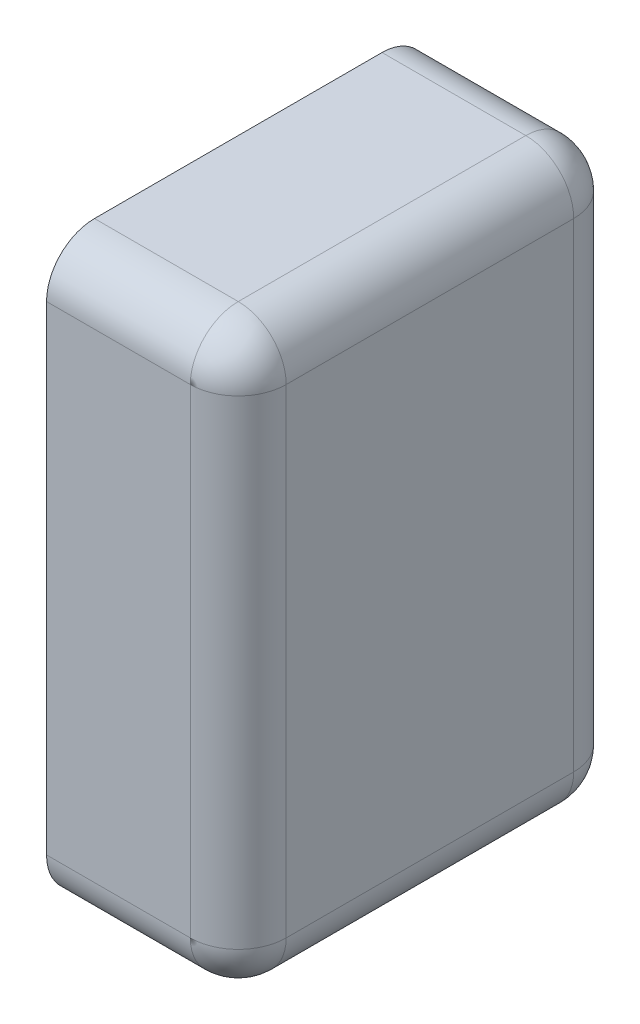
ISO-10303-21;
HEADER;
FILE_DESCRIPTION(('STEP AP214'),'2;1');
FILE_NAME('part.step','',(''),(''),'','','');
FILE_SCHEMA(('AUTOMOTIVE_DESIGN { 1 0 10303 214 1 1 1 1 }'));
ENDSEC;
DATA;
#1=APPLICATION_CONTEXT('core data for automotive mechanical design processes');
#2=APPLICATION_PROTOCOL_DEFINITION('international standard','automotive_design',2000,#1);
#3=PRODUCT_CONTEXT('',#1,'mechanical');
#4=PRODUCT('Part','Part','',(#3));
#5=PRODUCT_RELATED_PRODUCT_CATEGORY('part','',(#4));
#6=PRODUCT_DEFINITION_FORMATION('','',#4);
#7=PRODUCT_DEFINITION_CONTEXT('part definition',#1,'design');
#8=PRODUCT_DEFINITION('design','',#6,#7);
#9=PRODUCT_DEFINITION_SHAPE('','',#8);
#10=(LENGTH_UNIT() NAMED_UNIT(*) SI_UNIT(.MILLI.,.METRE.));
#11=(NAMED_UNIT(*) PLANE_ANGLE_UNIT() SI_UNIT($,.RADIAN.));
#12=(NAMED_UNIT(*) SI_UNIT($,.STERADIAN.) SOLID_ANGLE_UNIT());
#13=UNCERTAINTY_MEASURE_WITH_UNIT(LENGTH_MEASURE(1.E-05),#10,'distance_accuracy_value','');
#14=(GEOMETRIC_REPRESENTATION_CONTEXT(3) GLOBAL_UNCERTAINTY_ASSIGNED_CONTEXT((#13)) GLOBAL_UNIT_ASSIGNED_CONTEXT((#10,
#11,#12)) REPRESENTATION_CONTEXT('',''));
#15=CARTESIAN_POINT('',(0.,0.,0.));
#16=DIRECTION('',(0.,0.,1.));
#17=DIRECTION('',(1.,0.,0.));
#18=AXIS2_PLACEMENT_3D('',#15,#16,#17);
#19=CARTESIAN_POINT('',(0.275,-0.125,0.1));
#20=DIRECTION('',(0.,0.,-1.));
#21=DIRECTION('',(1.,0.,0.));
#22=AXIS2_PLACEMENT_3D('',#19,#20,#21);
#23=CYLINDRICAL_SURFACE('',#22,0.025);
#24=CARTESIAN_POINT('',(0.275,-0.125,0.025));
#25=DIRECTION('',(0.,0.,1.));
#26=DIRECTION('',(0.,1.,0.));
#27=AXIS2_PLACEMENT_3D('',#24,#25,#26);
#28=CIRCLE('',#27,0.025);
#29=CARTESIAN_POINT('',(0.275,-0.15,0.025));
#30=VERTEX_POINT('',#29);
#31=CARTESIAN_POINT('',(0.3,-0.125,0.025));
#32=VERTEX_POINT('',#31);
#33=EDGE_CURVE('E11',#30,#32,#28,.T.);
#34=ORIENTED_EDGE('',*,*,#33,.T.);
#35=DIRECTION('',(0.,0.,-1.));
#36=VECTOR('',#35,1.);
#37=CARTESIAN_POINT('',(0.3,-0.125,0.));
#38=LINE('',#37,#36);
#39=CARTESIAN_POINT('',(0.3,-0.125,0.175));
#40=VERTEX_POINT('',#39);
#41=EDGE_CURVE('E178',#40,#32,#38,.T.);
#42=ORIENTED_EDGE('',*,*,#41,.F.);
#43=CARTESIAN_POINT('',(0.275,-0.125,0.175));
#44=DIRECTION('',(0.,0.,1.));
#45=DIRECTION('',(1.,0.,0.));
#46=AXIS2_PLACEMENT_3D('',#43,#44,#45);
#47=CIRCLE('',#46,0.025);
#48=CARTESIAN_POINT('',(0.275,-0.15,0.175));
#49=VERTEX_POINT('',#48);
#50=EDGE_CURVE('E200',#49,#40,#47,.T.);
#51=ORIENTED_EDGE('',*,*,#50,.F.);
#52=DIRECTION('',(0.,0.,1.));
#53=VECTOR('',#52,1.);
#54=CARTESIAN_POINT('',(0.275,-0.15,0.2));
#55=LINE('',#54,#53);
#56=EDGE_CURVE('E87',#30,#49,#55,.T.);
#57=ORIENTED_EDGE('',*,*,#56,.F.);
#58=EDGE_LOOP('',(#34,#42,#51,#57));
#59=FACE_BOUND('',#58,.T.);
#60=ADVANCED_FACE('F17',(#59),#23,.T.);
#61=CARTESIAN_POINT('',(0.275,0.125,0.025));
#62=DIRECTION('',(0.,0.,1.));
#63=DIRECTION('',(1.,0.,0.));
#64=AXIS2_PLACEMENT_3D('',#61,#62,#63);
#65=SPHERICAL_SURFACE('',#64,0.025);
#66=CARTESIAN_POINT('',(0.275,0.125,0.025));
#67=DIRECTION('',(0.,1.,0.));
#68=DIRECTION('',(0.,0.,1.));
#69=AXIS2_PLACEMENT_3D('',#66,#67,#68);
#70=CIRCLE('',#69,0.025);
#71=CARTESIAN_POINT('',(0.3,0.125,0.025));
#72=VERTEX_POINT('',#71);
#73=CARTESIAN_POINT('',(0.275,0.125,0.));
#74=VERTEX_POINT('',#73);
#75=EDGE_CURVE('E212',#72,#74,#70,.T.);
#76=ORIENTED_EDGE('',*,*,#75,.T.);
#77=CARTESIAN_POINT('',(0.275,0.125,0.025));
#78=DIRECTION('',(1.,0.,0.));
#79=DIRECTION('',(0.,0.,-1.));
#80=AXIS2_PLACEMENT_3D('',#77,#78,#79);
#81=CIRCLE('',#80,0.025);
#82=CARTESIAN_POINT('',(0.275,0.15,0.025));
#83=VERTEX_POINT('',#82);
#84=EDGE_CURVE('E28',#74,#83,#81,.T.);
#85=ORIENTED_EDGE('',*,*,#84,.T.);
#86=CARTESIAN_POINT('',(0.275,0.125,0.025));
#87=DIRECTION('',(0.,0.,1.));
#88=DIRECTION('',(-1.,0.,0.));
#89=AXIS2_PLACEMENT_3D('',#86,#87,#88);
#90=CIRCLE('',#89,0.025);
#91=EDGE_CURVE('E232',#72,#83,#90,.T.);
#92=ORIENTED_EDGE('',*,*,#91,.F.);
#93=EDGE_LOOP('',(#76,#85,#92));
#94=FACE_BOUND('',#93,.T.);
#95=ADVANCED_FACE('F274',(#94),#65,.T.);
#96=CARTESIAN_POINT('',(0.275,-0.125,0.025));
#97=DIRECTION('',(0.,0.,1.));
#98=DIRECTION('',(1.,0.,0.));
#99=AXIS2_PLACEMENT_3D('',#96,#97,#98);
#100=SPHERICAL_SURFACE('',#99,0.025);
#101=CARTESIAN_POINT('',(0.275,-0.125,0.025));
#102=DIRECTION('',(1.,0.,0.));
#103=DIRECTION('',(0.,0.,-1.));
#104=AXIS2_PLACEMENT_3D('',#101,#102,#103);
#105=CIRCLE('',#104,0.025);
#106=CARTESIAN_POINT('',(0.275,-0.125,0.));
#107=VERTEX_POINT('',#106);
#108=EDGE_CURVE('E138',#30,#107,#105,.T.);
#109=ORIENTED_EDGE('',*,*,#108,.T.);
#110=CARTESIAN_POINT('',(0.275,-0.125,0.025));
#111=DIRECTION('',(0.,-1.,0.));
#112=DIRECTION('',(0.,0.,-1.));
#113=AXIS2_PLACEMENT_3D('',#110,#111,#112);
#114=CIRCLE('',#113,0.025);
#115=EDGE_CURVE('E213',#107,#32,#114,.T.);
#116=ORIENTED_EDGE('',*,*,#115,.T.);
#117=ORIENTED_EDGE('',*,*,#33,.F.);
#118=EDGE_LOOP('',(#109,#116,#117));
#119=FACE_BOUND('',#118,.T.);
#120=ADVANCED_FACE('F280',(#119),#100,.T.);
#121=CARTESIAN_POINT('',(0.15,0.125,0.025));
#122=DIRECTION('',(1.,0.,0.));
#123=DIRECTION('',(0.,0.,1.));
#124=AXIS2_PLACEMENT_3D('',#121,#122,#123);
#125=CYLINDRICAL_SURFACE('',#124,0.025);
#126=CARTESIAN_POINT('',(0.2,0.125,0.025));
#127=DIRECTION('',(-1.,0.,0.));
#128=DIRECTION('',(0.,0.,-1.));
#129=AXIS2_PLACEMENT_3D('',#126,#127,#128);
#130=CIRCLE('',#129,0.025);
#131=CARTESIAN_POINT('',(0.2,0.15,0.025));
#132=VERTEX_POINT('',#131);
#133=CARTESIAN_POINT('',(0.2,0.125,0.));
#134=VERTEX_POINT('',#133);
#135=EDGE_CURVE('E131',#132,#134,#130,.T.);
#136=ORIENTED_EDGE('',*,*,#135,.F.);
#137=DIRECTION('',(-1.,0.,0.));
#138=VECTOR('',#137,1.);
#139=CARTESIAN_POINT('',(0.15,0.15,0.025));
#140=LINE('',#139,#138);
#141=EDGE_CURVE('E182',#83,#132,#140,.T.);
#142=ORIENTED_EDGE('',*,*,#141,.F.);
#143=ORIENTED_EDGE('',*,*,#84,.F.);
#144=DIRECTION('',(1.,0.,0.));
#145=VECTOR('',#144,1.);
#146=CARTESIAN_POINT('',(0.25,0.125,0.));
#147=LINE('',#146,#145);
#148=EDGE_CURVE('E127',#134,#74,#147,.T.);
#149=ORIENTED_EDGE('',*,*,#148,.F.);
#150=EDGE_LOOP('',(#136,#142,#143,#149));
#151=FACE_BOUND('',#150,.T.);
#152=ADVANCED_FACE('F129',(#151),#125,.T.);
#153=CARTESIAN_POINT('',(0.25,-0.125,0.025));
#154=DIRECTION('',(-1.,0.,0.));
#155=DIRECTION('',(0.,0.,-1.));
#156=AXIS2_PLACEMENT_3D('',#153,#154,#155);
#157=CYLINDRICAL_SURFACE('',#156,0.025);
#158=CARTESIAN_POINT('',(0.2,-0.125,0.025));
#159=DIRECTION('',(-1.,0.,0.));
#160=DIRECTION('',(0.,0.,-1.));
#161=AXIS2_PLACEMENT_3D('',#158,#159,#160);
#162=CIRCLE('',#161,0.025);
#163=CARTESIAN_POINT('',(0.2,-0.125,0.));
#164=VERTEX_POINT('',#163);
#165=CARTESIAN_POINT('',(0.2,-0.15,0.025));
#166=VERTEX_POINT('',#165);
#167=EDGE_CURVE('E155',#164,#166,#162,.T.);
#168=ORIENTED_EDGE('',*,*,#167,.F.);
#169=DIRECTION('',(-1.,0.,0.));
#170=VECTOR('',#169,1.);
#171=CARTESIAN_POINT('',(0.2,-0.125,0.));
#172=LINE('',#171,#170);
#173=EDGE_CURVE('E139',#107,#164,#172,.T.);
#174=ORIENTED_EDGE('',*,*,#173,.F.);
#175=ORIENTED_EDGE('',*,*,#108,.F.);
#176=DIRECTION('',(1.,0.,0.));
#177=VECTOR('',#176,1.);
#178=CARTESIAN_POINT('',(0.3,-0.15,0.025));
#179=LINE('',#178,#177);
#180=EDGE_CURVE('E174',#166,#30,#179,.T.);
#181=ORIENTED_EDGE('',*,*,#180,.F.);
#182=EDGE_LOOP('',(#168,#174,#175,#181));
#183=FACE_BOUND('',#182,.T.);
#184=ADVANCED_FACE('F272',(#183),#157,.T.);
#185=CARTESIAN_POINT('',(0.25,-0.15,0.));
#186=DIRECTION('',(0.,0.,1.));
#187=DIRECTION('',(1.,0.,0.));
#188=AXIS2_PLACEMENT_3D('',#185,#186,#187);
#189=PLANE('',#188);
#190=DIRECTION('',(0.,-1.,0.));
#191=VECTOR('',#190,1.);
#192=CARTESIAN_POINT('',(0.275,-0.15,0.));
#193=LINE('',#192,#191);
#194=EDGE_CURVE('E209',#74,#107,#193,.T.);
#195=ORIENTED_EDGE('',*,*,#194,.T.);
#196=ORIENTED_EDGE('',*,*,#173,.T.);
#197=DIRECTION('',(0.,1.,0.));
#198=VECTOR('',#197,1.);
#199=CARTESIAN_POINT('',(0.2,-0.15,0.));
#200=LINE('',#199,#198);
#201=EDGE_CURVE('E145',#164,#134,#200,.T.);
#202=ORIENTED_EDGE('',*,*,#201,.T.);
#203=ORIENTED_EDGE('',*,*,#148,.T.);
#204=EDGE_LOOP('',(#195,#196,#202,#203));
#205=FACE_BOUND('',#204,.T.);
#206=ADVANCED_FACE('F151',(#205),#189,.F.);
#207=CARTESIAN_POINT('',(0.3,-0.15,0.1));
#208=DIRECTION('',(-1.,0.,0.));
#209=DIRECTION('',(0.,0.,1.));
#210=AXIS2_PLACEMENT_3D('',#207,#208,#209);
#211=PLANE('',#210);
#212=DIRECTION('',(0.,-1.,0.));
#213=VECTOR('',#212,1.);
#214=CARTESIAN_POINT('',(0.3,-0.15,0.175));
#215=LINE('',#214,#213);
#216=CARTESIAN_POINT('',(0.3,0.125,0.175));
#217=VERTEX_POINT('',#216);
#218=EDGE_CURVE('E188',#217,#40,#215,.T.);
#219=ORIENTED_EDGE('',*,*,#218,.T.);
#220=ORIENTED_EDGE('',*,*,#41,.T.);
#221=DIRECTION('',(0.,1.,0.));
#222=VECTOR('',#221,1.);
#223=CARTESIAN_POINT('',(0.3,-0.15,0.025));
#224=LINE('',#223,#222);
#225=EDGE_CURVE('E177',#32,#72,#224,.T.);
#226=ORIENTED_EDGE('',*,*,#225,.T.);
#227=DIRECTION('',(0.,0.,1.));
#228=VECTOR('',#227,1.);
#229=CARTESIAN_POINT('',(0.3,0.125,0.1));
#230=LINE('',#229,#228);
#231=EDGE_CURVE('E198',#72,#217,#230,.T.);
#232=ORIENTED_EDGE('',*,*,#231,.T.);
#233=EDGE_LOOP('',(#219,#220,#226,#232));
#234=FACE_BOUND('',#233,.T.);
#235=ADVANCED_FACE('F255',(#234),#211,.F.);
#236=CARTESIAN_POINT('',(0.15,0.15,0.1));
#237=DIRECTION('',(0.,-1.,0.));
#238=DIRECTION('',(0.,0.,-1.));
#239=AXIS2_PLACEMENT_3D('',#236,#237,#238);
#240=PLANE('',#239);
#241=DIRECTION('',(0.,0.,-1.));
#242=VECTOR('',#241,1.);
#243=CARTESIAN_POINT('',(0.275,0.15,0.1));
#244=LINE('',#243,#242);
#245=CARTESIAN_POINT('',(0.275,0.15,0.175));
#246=VERTEX_POINT('',#245);
#247=EDGE_CURVE('E208',#246,#83,#244,.T.);
#248=ORIENTED_EDGE('',*,*,#247,.T.);
#249=ORIENTED_EDGE('',*,*,#141,.T.);
#250=DIRECTION('',(0.,0.,1.));
#251=VECTOR('',#250,1.);
#252=CARTESIAN_POINT('',(0.2,0.15,0.189600024));
#253=LINE('',#252,#251);
#254=CARTESIAN_POINT('',(0.2,0.15,0.175));
#255=VERTEX_POINT('',#254);
#256=EDGE_CURVE('E147',#132,#255,#253,.T.);
#257=ORIENTED_EDGE('',*,*,#256,.T.);
#258=DIRECTION('',(1.,0.,0.));
#259=VECTOR('',#258,1.);
#260=CARTESIAN_POINT('',(0.15,0.15,0.175));
#261=LINE('',#260,#259);
#262=EDGE_CURVE('E236',#255,#246,#261,.T.);
#263=ORIENTED_EDGE('',*,*,#262,.T.);
#264=EDGE_LOOP('',(#248,#249,#257,#263));
#265=FACE_BOUND('',#264,.T.);
#266=ADVANCED_FACE('F294',(#265),#240,.F.);
#267=CARTESIAN_POINT('',(0.15,-0.15,0.1));
#268=DIRECTION('',(0.,-1.,0.));
#269=DIRECTION('',(0.,0.,-1.));
#270=AXIS2_PLACEMENT_3D('',#267,#268,#269);
#271=PLANE('',#270);
#272=DIRECTION('',(0.,0.,1.));
#273=VECTOR('',#272,1.);
#274=CARTESIAN_POINT('',(0.2,-0.15,0.189600024));
#275=LINE('',#274,#273);
#276=CARTESIAN_POINT('',(0.2,-0.15,0.175));
#277=VERTEX_POINT('',#276);
#278=EDGE_CURVE('E162',#166,#277,#275,.T.);
#279=ORIENTED_EDGE('',*,*,#278,.F.);
#280=ORIENTED_EDGE('',*,*,#180,.T.);
#281=ORIENTED_EDGE('',*,*,#56,.T.);
#282=DIRECTION('',(-1.,0.,0.));
#283=VECTOR('',#282,1.);
#284=CARTESIAN_POINT('',(0.2,-0.15,0.175));
#285=LINE('',#284,#283);
#286=EDGE_CURVE('E197',#49,#277,#285,.T.);
#287=ORIENTED_EDGE('',*,*,#286,.T.);
#288=EDGE_LOOP('',(#279,#280,#281,#287));
#289=FACE_BOUND('',#288,.T.);
#290=ADVANCED_FACE('F270',(#289),#271,.T.);
#291=CARTESIAN_POINT('',(0.275,-0.15,0.025));
#292=DIRECTION('',(0.,-1.,0.));
#293=DIRECTION('',(0.,0.,1.));
#294=AXIS2_PLACEMENT_3D('',#291,#292,#293);
#295=CYLINDRICAL_SURFACE('',#294,0.025);
#296=ORIENTED_EDGE('',*,*,#115,.F.);
#297=ORIENTED_EDGE('',*,*,#194,.F.);
#298=ORIENTED_EDGE('',*,*,#75,.F.);
#299=ORIENTED_EDGE('',*,*,#225,.F.);
#300=EDGE_LOOP('',(#296,#297,#298,#299));
#301=FACE_BOUND('',#300,.T.);
#302=ADVANCED_FACE('F19',(#301),#295,.T.);
#303=CARTESIAN_POINT('',(0.275,-0.125,0.175));
#304=DIRECTION('',(0.,0.,1.));
#305=DIRECTION('',(1.,0.,0.));
#306=AXIS2_PLACEMENT_3D('',#303,#304,#305);
#307=SPHERICAL_SURFACE('',#306,0.025);
#308=CARTESIAN_POINT('',(0.275,-0.125,0.175));
#309=DIRECTION('',(1.,0.,0.));
#310=DIRECTION('',(0.,0.,-1.));
#311=AXIS2_PLACEMENT_3D('',#308,#309,#310);
#312=CIRCLE('',#311,0.025);
#313=CARTESIAN_POINT('',(0.275,-0.125,0.2));
#314=VERTEX_POINT('',#313);
#315=EDGE_CURVE('E166',#314,#49,#312,.T.);
#316=ORIENTED_EDGE('',*,*,#315,.T.);
#317=ORIENTED_EDGE('',*,*,#50,.T.);
#318=CARTESIAN_POINT('',(0.275,-0.125,0.175));
#319=DIRECTION('',(0.,1.,0.));
#320=DIRECTION('',(0.,0.,-1.));
#321=AXIS2_PLACEMENT_3D('',#318,#319,#320);
#322=CIRCLE('',#321,0.025);
#323=EDGE_CURVE('E72',#314,#40,#322,.T.);
#324=ORIENTED_EDGE('',*,*,#323,.F.);
#325=EDGE_LOOP('',(#316,#317,#324));
#326=FACE_BOUND('',#325,.T.);
#327=ADVANCED_FACE('F249',(#326),#307,.T.);
#328=CARTESIAN_POINT('',(0.275,0.125,0.175));
#329=DIRECTION('',(0.,0.,1.));
#330=DIRECTION('',(1.,0.,0.));
#331=AXIS2_PLACEMENT_3D('',#328,#329,#330);
#332=SPHERICAL_SURFACE('',#331,0.025);
#333=CARTESIAN_POINT('',(0.275,0.125,0.175));
#334=DIRECTION('',(0.,0.,1.));
#335=DIRECTION('',(1.,0.,0.));
#336=AXIS2_PLACEMENT_3D('',#333,#334,#335);
#337=CIRCLE('',#336,0.025);
#338=EDGE_CURVE('E204',#217,#246,#337,.T.);
#339=ORIENTED_EDGE('',*,*,#338,.T.);
#340=CARTESIAN_POINT('',(0.275,0.125,0.175));
#341=DIRECTION('',(1.,0.,0.));
#342=DIRECTION('',(0.,0.,-1.));
#343=AXIS2_PLACEMENT_3D('',#340,#341,#342);
#344=CIRCLE('',#343,0.025);
#345=CARTESIAN_POINT('',(0.275,0.125,0.2));
#346=VERTEX_POINT('',#345);
#347=EDGE_CURVE('E170',#246,#346,#344,.T.);
#348=ORIENTED_EDGE('',*,*,#347,.T.);
#349=CARTESIAN_POINT('',(0.275,0.125,0.175));
#350=DIRECTION('',(0.,-1.,0.));
#351=DIRECTION('',(0.,0.,1.));
#352=AXIS2_PLACEMENT_3D('',#349,#350,#351);
#353=CIRCLE('',#352,0.025);
#354=EDGE_CURVE('E192',#217,#346,#353,.T.);
#355=ORIENTED_EDGE('',*,*,#354,.F.);
#356=EDGE_LOOP('',(#339,#348,#355));
#357=FACE_BOUND('',#356,.T.);
#358=ADVANCED_FACE('F312',(#357),#332,.T.);
#359=CARTESIAN_POINT('',(0.275,-0.15,0.175));
#360=DIRECTION('',(0.,-1.,0.));
#361=DIRECTION('',(0.,0.,1.));
#362=AXIS2_PLACEMENT_3D('',#359,#360,#361);
#363=CYLINDRICAL_SURFACE('',#362,0.025);
#364=ORIENTED_EDGE('',*,*,#323,.T.);
#365=ORIENTED_EDGE('',*,*,#218,.F.);
#366=ORIENTED_EDGE('',*,*,#354,.T.);
#367=DIRECTION('',(0.,1.,0.));
#368=VECTOR('',#367,1.);
#369=CARTESIAN_POINT('',(0.275,-0.15,0.2));
#370=LINE('',#369,#368);
#371=EDGE_CURVE('E149',#314,#346,#370,.T.);
#372=ORIENTED_EDGE('',*,*,#371,.F.);
#373=EDGE_LOOP('',(#364,#365,#366,#372));
#374=FACE_BOUND('',#373,.T.);
#375=ADVANCED_FACE('F260',(#374),#363,.T.);
#376=CARTESIAN_POINT('',(0.25,-0.15,0.2));
#377=DIRECTION('',(0.,0.,-1.));
#378=DIRECTION('',(0.,-1.,0.));
#379=AXIS2_PLACEMENT_3D('',#376,#377,#378);
#380=PLANE('',#379);
#381=DIRECTION('',(0.,1.,0.));
#382=VECTOR('',#381,1.);
#383=CARTESIAN_POINT('',(0.2,-0.15,0.2));
#384=LINE('',#383,#382);
#385=CARTESIAN_POINT('',(0.2,-0.125,0.2));
#386=VERTEX_POINT('',#385);
#387=CARTESIAN_POINT('',(0.2,0.125,0.2));
#388=VERTEX_POINT('',#387);
#389=EDGE_CURVE('E172',#386,#388,#384,.T.);
#390=ORIENTED_EDGE('',*,*,#389,.F.);
#391=DIRECTION('',(1.,0.,0.));
#392=VECTOR('',#391,1.);
#393=CARTESIAN_POINT('',(0.3,-0.125,0.2));
#394=LINE('',#393,#392);
#395=EDGE_CURVE('E156',#386,#314,#394,.T.);
#396=ORIENTED_EDGE('',*,*,#395,.T.);
#397=ORIENTED_EDGE('',*,*,#371,.T.);
#398=DIRECTION('',(-1.,0.,0.));
#399=VECTOR('',#398,1.);
#400=CARTESIAN_POINT('',(0.25,0.125,0.2));
#401=LINE('',#400,#399);
#402=EDGE_CURVE('E21',#346,#388,#401,.T.);
#403=ORIENTED_EDGE('',*,*,#402,.T.);
#404=EDGE_LOOP('',(#390,#396,#397,#403));
#405=FACE_BOUND('',#404,.T.);
#406=ADVANCED_FACE('F265',(#405),#380,.F.);
#407=CARTESIAN_POINT('',(0.2,-0.15,0.189600024));
#408=DIRECTION('',(1.,0.,0.));
#409=DIRECTION('',(0.,1.,0.));
#410=AXIS2_PLACEMENT_3D('',#407,#408,#409);
#411=PLANE('',#410);
#412=ORIENTED_EDGE('',*,*,#201,.F.);
#413=ORIENTED_EDGE('',*,*,#167,.T.);
#414=ORIENTED_EDGE('',*,*,#278,.T.);
#415=CARTESIAN_POINT('',(0.2,-0.125,0.175));
#416=DIRECTION('',(-1.,0.,0.));
#417=DIRECTION('',(0.,0.,-1.));
#418=AXIS2_PLACEMENT_3D('',#415,#416,#417);
#419=CIRCLE('',#418,0.025);
#420=EDGE_CURVE('E193',#277,#386,#419,.T.);
#421=ORIENTED_EDGE('',*,*,#420,.T.);
#422=ORIENTED_EDGE('',*,*,#389,.T.);
#423=CARTESIAN_POINT('',(0.2,0.125,0.175));
#424=DIRECTION('',(-1.,0.,0.));
#425=DIRECTION('',(0.,0.,-1.));
#426=AXIS2_PLACEMENT_3D('',#423,#424,#425);
#427=CIRCLE('',#426,0.025);
#428=EDGE_CURVE('E226',#388,#255,#427,.T.);
#429=ORIENTED_EDGE('',*,*,#428,.T.);
#430=ORIENTED_EDGE('',*,*,#256,.F.);
#431=ORIENTED_EDGE('',*,*,#135,.T.);
#432=EDGE_LOOP('',(#412,#413,#414,#421,#422,#429,#430,#431));
#433=FACE_BOUND('',#432,.T.);
#434=ADVANCED_FACE('F143',(#433),#411,.F.);
#435=CARTESIAN_POINT('',(0.25,-0.125,0.175));
#436=DIRECTION('',(1.,0.,0.));
#437=DIRECTION('',(0.,0.,1.));
#438=AXIS2_PLACEMENT_3D('',#435,#436,#437);
#439=CYLINDRICAL_SURFACE('',#438,0.025);
#440=ORIENTED_EDGE('',*,*,#420,.F.);
#441=ORIENTED_EDGE('',*,*,#286,.F.);
#442=ORIENTED_EDGE('',*,*,#315,.F.);
#443=ORIENTED_EDGE('',*,*,#395,.F.);
#444=EDGE_LOOP('',(#440,#441,#442,#443));
#445=FACE_BOUND('',#444,.T.);
#446=ADVANCED_FACE('F268',(#445),#439,.T.);
#447=CARTESIAN_POINT('',(0.275,0.125,0.1));
#448=DIRECTION('',(0.,0.,1.));
#449=DIRECTION('',(-1.,0.,0.));
#450=AXIS2_PLACEMENT_3D('',#447,#448,#449);
#451=CYLINDRICAL_SURFACE('',#450,0.025);
#452=ORIENTED_EDGE('',*,*,#91,.T.);
#453=ORIENTED_EDGE('',*,*,#247,.F.);
#454=ORIENTED_EDGE('',*,*,#338,.F.);
#455=ORIENTED_EDGE('',*,*,#231,.F.);
#456=EDGE_LOOP('',(#452,#453,#454,#455));
#457=FACE_BOUND('',#456,.T.);
#458=ADVANCED_FACE('F297',(#457),#451,.T.);
#459=CARTESIAN_POINT('',(0.15,0.125,0.175));
#460=DIRECTION('',(-1.,0.,0.));
#461=DIRECTION('',(0.,0.,-1.));
#462=AXIS2_PLACEMENT_3D('',#459,#460,#461);
#463=CYLINDRICAL_SURFACE('',#462,0.025);
#464=ORIENTED_EDGE('',*,*,#428,.F.);
#465=ORIENTED_EDGE('',*,*,#402,.F.);
#466=ORIENTED_EDGE('',*,*,#347,.F.);
#467=ORIENTED_EDGE('',*,*,#262,.F.);
#468=EDGE_LOOP('',(#464,#465,#466,#467));
#469=FACE_BOUND('',#468,.T.);
#470=ADVANCED_FACE('F302',(#469),#463,.T.);
#471=CLOSED_SHELL('',(#60,#95,#120,#152,#184,#206,#235,#266,#290,#302,#327,#358,#375,#406,#434,
#446,#458,#470));
#472=MANIFOLD_SOLID_BREP('B1',#471);
#473=ADVANCED_BREP_SHAPE_REPRESENTATION('',(#18,#472),#14);
#474=SHAPE_DEFINITION_REPRESENTATION(#9,#473);
ENDSEC;
END-ISO-10303-21;
